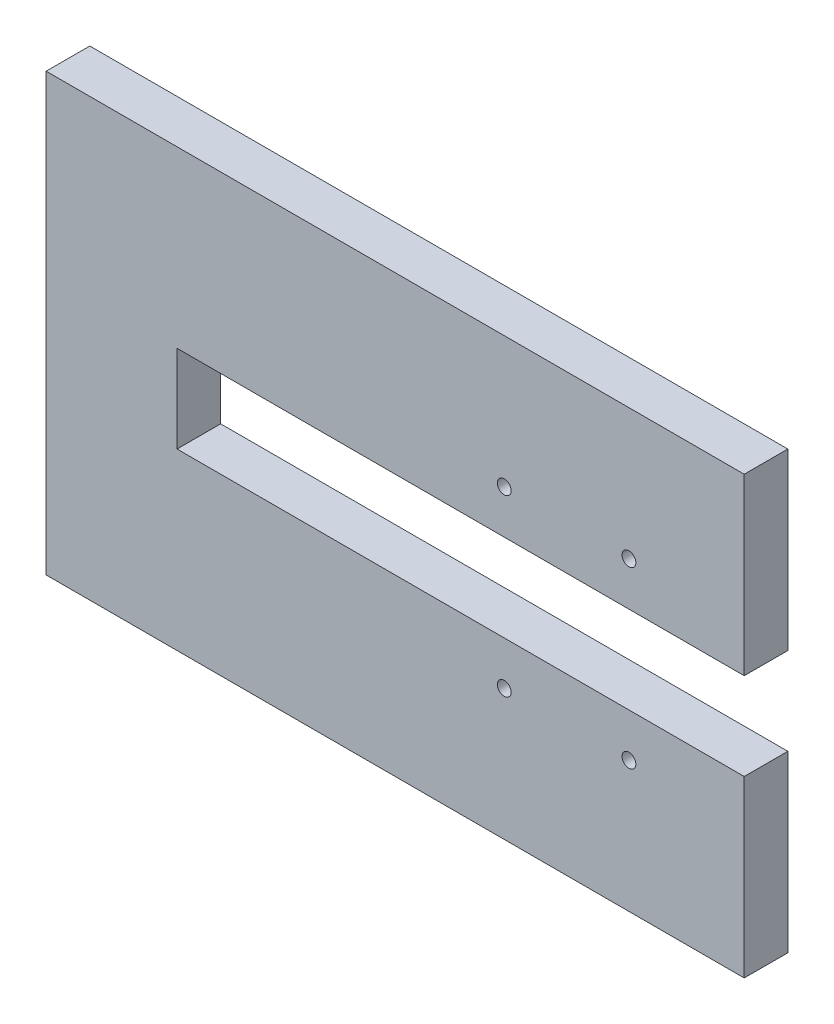
ISO-10303-21;
HEADER;
FILE_DESCRIPTION(('STEP AP214'),'2;1');
FILE_NAME('part.step','',(''),(''),'','','');
FILE_SCHEMA(('AUTOMOTIVE_DESIGN { 1 0 10303 214 1 1 1 1 }'));
ENDSEC;
DATA;
#1=APPLICATION_CONTEXT('core data for automotive mechanical design processes');
#2=APPLICATION_PROTOCOL_DEFINITION('international standard','automotive_design',2000,#1);
#3=PRODUCT_CONTEXT('',#1,'mechanical');
#4=PRODUCT('Part','Part','',(#3));
#5=PRODUCT_RELATED_PRODUCT_CATEGORY('part','',(#4));
#6=PRODUCT_DEFINITION_FORMATION('','',#4);
#7=PRODUCT_DEFINITION_CONTEXT('part definition',#1,'design');
#8=PRODUCT_DEFINITION('design','',#6,#7);
#9=PRODUCT_DEFINITION_SHAPE('','',#8);
#10=(LENGTH_UNIT() NAMED_UNIT(*) SI_UNIT(.MILLI.,.METRE.));
#11=(NAMED_UNIT(*) PLANE_ANGLE_UNIT() SI_UNIT($,.RADIAN.));
#12=(NAMED_UNIT(*) SI_UNIT($,.STERADIAN.) SOLID_ANGLE_UNIT());
#13=UNCERTAINTY_MEASURE_WITH_UNIT(LENGTH_MEASURE(1.E-05),#10,'distance_accuracy_value','');
#14=(GEOMETRIC_REPRESENTATION_CONTEXT(3) GLOBAL_UNCERTAINTY_ASSIGNED_CONTEXT((#13)) GLOBAL_UNIT_ASSIGNED_CONTEXT((#10,
#11,#12)) REPRESENTATION_CONTEXT('',''));
#15=CARTESIAN_POINT('',(0.,0.,0.));
#16=DIRECTION('',(0.,0.,1.));
#17=DIRECTION('',(1.,0.,0.));
#18=AXIS2_PLACEMENT_3D('',#15,#16,#17);
#19=CARTESIAN_POINT('',(0.,0.,10.));
#20=DIRECTION('',(0.,0.,1.));
#21=DIRECTION('',(1.,0.,0.));
#22=AXIS2_PLACEMENT_3D('',#19,#20,#21);
#23=PLANE('',#22);
#24=CARTESIAN_POINT('',(51.4623762836953,-5.11498133483865,10.));
#25=DIRECTION('',(0.,0.,1.));
#26=DIRECTION('',(1.,0.,0.));
#27=AXIS2_PLACEMENT_3D('',#24,#25,#26);
#28=CIRCLE('',#27,1.5875);
#29=CARTESIAN_POINT('',(53.0498762836953,-5.11498133483865,10.));
#30=VERTEX_POINT('',#29);
#31=EDGE_CURVE('E187',#30,#30,#28,.T.);
#32=ORIENTED_EDGE('',*,*,#31,.F.);
#33=EDGE_LOOP('',(#32));
#34=FACE_BOUND('',#33,.T.);
#35=CARTESIAN_POINT('',(51.4623762836953,34.8850186651615,10.));
#36=DIRECTION('',(0.,0.,1.));
#37=DIRECTION('',(1.,0.,0.));
#38=AXIS2_PLACEMENT_3D('',#35,#36,#37);
#39=CIRCLE('',#38,1.5875);
#40=CARTESIAN_POINT('',(53.0498762836953,34.8850186651615,10.));
#41=VERTEX_POINT('',#40);
#42=EDGE_CURVE('E133',#41,#41,#39,.T.);
#43=ORIENTED_EDGE('',*,*,#42,.F.);
#44=EDGE_LOOP('',(#43));
#45=FACE_BOUND('',#44,.T.);
#46=DIRECTION('',(0.,-1.,0.));
#47=VECTOR('',#46,1.);
#48=CARTESIAN_POINT('',(-53.5376237163047,64.8850186651614,10.));
#49=LINE('',#48,#47);
#50=CARTESIAN_POINT('',(-53.5376237163047,64.8850186651614,10.));
#51=VERTEX_POINT('',#50);
#52=CARTESIAN_POINT('',(-53.5376237163047,-35.1149813348386,10.));
#53=VERTEX_POINT('',#52);
#54=EDGE_CURVE('E144',#51,#53,#49,.T.);
#55=ORIENTED_EDGE('',*,*,#54,.T.);
#56=DIRECTION('',(1.,0.,0.));
#57=VECTOR('',#56,1.);
#58=CARTESIAN_POINT('',(-53.5376237163047,-35.1149813348386,10.));
#59=LINE('',#58,#57);
#60=CARTESIAN_POINT('',(106.462376283695,-35.1149813348386,10.));
#61=VERTEX_POINT('',#60);
#62=EDGE_CURVE('E92',#53,#61,#59,.T.);
#63=ORIENTED_EDGE('',*,*,#62,.T.);
#64=DIRECTION('',(0.,1.,0.));
#65=VECTOR('',#64,1.);
#66=CARTESIAN_POINT('',(106.462376283695,-35.1149813348386,10.));
#67=LINE('',#66,#65);
#68=CARTESIAN_POINT('',(106.462376283695,4.88501866516136,10.));
#69=VERTEX_POINT('',#68);
#70=EDGE_CURVE('E159',#61,#69,#67,.T.);
#71=ORIENTED_EDGE('',*,*,#70,.T.);
#72=DIRECTION('',(-1.,0.,0.));
#73=VECTOR('',#72,1.);
#74=CARTESIAN_POINT('',(106.462376283695,4.88501866516136,10.));
#75=LINE('',#74,#73);
#76=CARTESIAN_POINT('',(-23.5376237163047,4.88501866516135,10.));
#77=VERTEX_POINT('',#76);
#78=EDGE_CURVE('E172',#69,#77,#75,.T.);
#79=ORIENTED_EDGE('',*,*,#78,.T.);
#80=DIRECTION('',(0.,1.,0.));
#81=VECTOR('',#80,1.);
#82=CARTESIAN_POINT('',(-23.5376237163047,24.8850186651614,10.));
#83=LINE('',#82,#81);
#84=CARTESIAN_POINT('',(-23.5376237163047,24.8850186651614,10.));
#85=VERTEX_POINT('',#84);
#86=EDGE_CURVE('E111',#77,#85,#83,.T.);
#87=ORIENTED_EDGE('',*,*,#86,.T.);
#88=DIRECTION('',(1.,0.,0.));
#89=VECTOR('',#88,1.);
#90=CARTESIAN_POINT('',(106.462376283695,24.8850186651614,10.));
#91=LINE('',#90,#89);
#92=CARTESIAN_POINT('',(106.462376283695,24.8850186651614,10.));
#93=VERTEX_POINT('',#92);
#94=EDGE_CURVE('E105',#85,#93,#91,.T.);
#95=ORIENTED_EDGE('',*,*,#94,.T.);
#96=DIRECTION('',(0.,1.,0.));
#97=VECTOR('',#96,1.);
#98=CARTESIAN_POINT('',(106.462376283695,64.8850186651614,10.));
#99=LINE('',#98,#97);
#100=CARTESIAN_POINT('',(106.462376283695,64.8850186651614,10.));
#101=VERTEX_POINT('',#100);
#102=EDGE_CURVE('E109',#93,#101,#99,.T.);
#103=ORIENTED_EDGE('',*,*,#102,.T.);
#104=DIRECTION('',(-1.,0.,0.));
#105=VECTOR('',#104,1.);
#106=CARTESIAN_POINT('',(-53.5376237163047,64.8850186651614,10.));
#107=LINE('',#106,#105);
#108=EDGE_CURVE('E49',#101,#51,#107,.T.);
#109=ORIENTED_EDGE('',*,*,#108,.T.);
#110=EDGE_LOOP('',(#55,#63,#71,#79,#87,#95,#103,#109));
#111=FACE_BOUND('',#110,.T.);
#112=CARTESIAN_POINT('',(80.0373762836953,34.8850186651615,10.));
#113=DIRECTION('',(0.,0.,1.));
#114=DIRECTION('',(1.,0.,0.));
#115=AXIS2_PLACEMENT_3D('',#112,#113,#114);
#116=CIRCLE('',#115,1.58749999999999);
#117=CARTESIAN_POINT('',(81.6248762836952,34.8850186651615,10.));
#118=VERTEX_POINT('',#117);
#119=EDGE_CURVE('E181',#118,#118,#116,.T.);
#120=ORIENTED_EDGE('',*,*,#119,.F.);
#121=EDGE_LOOP('',(#120));
#122=FACE_BOUND('',#121,.T.);
#123=CARTESIAN_POINT('',(80.0373762836952,-5.11498133483865,10.));
#124=DIRECTION('',(0.,0.,1.));
#125=DIRECTION('',(1.,0.,0.));
#126=AXIS2_PLACEMENT_3D('',#123,#124,#125);
#127=CIRCLE('',#126,1.5875);
#128=CARTESIAN_POINT('',(81.6248762836952,-5.11498133483865,10.));
#129=VERTEX_POINT('',#128);
#130=EDGE_CURVE('E193',#129,#129,#127,.T.);
#131=ORIENTED_EDGE('',*,*,#130,.F.);
#132=EDGE_LOOP('',(#131));
#133=FACE_BOUND('',#132,.T.);
#134=ADVANCED_FACE('F32',(#34,#45,#111,#122,#133),#23,.T.);
#135=CARTESIAN_POINT('',(0.,0.,0.));
#136=DIRECTION('',(0.,0.,1.));
#137=DIRECTION('',(1.,0.,0.));
#138=AXIS2_PLACEMENT_3D('',#135,#136,#137);
#139=PLANE('',#138);
#140=CARTESIAN_POINT('',(51.4623762836953,-5.11498133483865,0.));
#141=DIRECTION('',(0.,0.,1.));
#142=DIRECTION('',(1.,0.,0.));
#143=AXIS2_PLACEMENT_3D('',#140,#141,#142);
#144=CIRCLE('',#143,1.5875);
#145=CARTESIAN_POINT('',(53.0498762836953,-5.11498133483865,0.));
#146=VERTEX_POINT('',#145);
#147=EDGE_CURVE('E190',#146,#146,#144,.T.);
#148=ORIENTED_EDGE('',*,*,#147,.T.);
#149=EDGE_LOOP('',(#148));
#150=FACE_BOUND('',#149,.T.);
#151=CARTESIAN_POINT('',(51.4623762836953,34.8850186651615,0.));
#152=DIRECTION('',(0.,0.,1.));
#153=DIRECTION('',(1.,0.,0.));
#154=AXIS2_PLACEMENT_3D('',#151,#152,#153);
#155=CIRCLE('',#154,1.5875);
#156=CARTESIAN_POINT('',(53.0498762836953,34.8850186651615,0.));
#157=VERTEX_POINT('',#156);
#158=EDGE_CURVE('E178',#157,#157,#155,.T.);
#159=ORIENTED_EDGE('',*,*,#158,.T.);
#160=EDGE_LOOP('',(#159));
#161=FACE_BOUND('',#160,.T.);
#162=DIRECTION('',(0.,-1.,0.));
#163=VECTOR('',#162,1.);
#164=CARTESIAN_POINT('',(-53.5376237163047,64.8850186651614,0.));
#165=LINE('',#164,#163);
#166=CARTESIAN_POINT('',(-53.5376237163047,64.8850186651614,0.));
#167=VERTEX_POINT('',#166);
#168=CARTESIAN_POINT('',(-53.5376237163047,-35.1149813348386,0.));
#169=VERTEX_POINT('',#168);
#170=EDGE_CURVE('E129',#167,#169,#165,.T.);
#171=ORIENTED_EDGE('',*,*,#170,.F.);
#172=DIRECTION('',(-1.,0.,0.));
#173=VECTOR('',#172,1.);
#174=CARTESIAN_POINT('',(-53.5376237163047,64.8850186651614,0.));
#175=LINE('',#174,#173);
#176=CARTESIAN_POINT('',(106.462376283695,64.8850186651614,0.));
#177=VERTEX_POINT('',#176);
#178=EDGE_CURVE('E84',#177,#167,#175,.T.);
#179=ORIENTED_EDGE('',*,*,#178,.F.);
#180=DIRECTION('',(0.,1.,0.));
#181=VECTOR('',#180,1.);
#182=CARTESIAN_POINT('',(106.462376283695,64.8850186651614,0.));
#183=LINE('',#182,#181);
#184=CARTESIAN_POINT('',(106.462376283695,24.8850186651614,0.));
#185=VERTEX_POINT('',#184);
#186=EDGE_CURVE('E78',#185,#177,#183,.T.);
#187=ORIENTED_EDGE('',*,*,#186,.F.);
#188=DIRECTION('',(1.,0.,0.));
#189=VECTOR('',#188,1.);
#190=CARTESIAN_POINT('',(106.462376283695,24.8850186651614,0.));
#191=LINE('',#190,#189);
#192=CARTESIAN_POINT('',(-23.5376237163047,24.8850186651614,0.));
#193=VERTEX_POINT('',#192);
#194=EDGE_CURVE('E119',#193,#185,#191,.T.);
#195=ORIENTED_EDGE('',*,*,#194,.F.);
#196=DIRECTION('',(0.,1.,0.));
#197=VECTOR('',#196,1.);
#198=CARTESIAN_POINT('',(-23.5376237163047,24.8850186651614,0.));
#199=LINE('',#198,#197);
#200=CARTESIAN_POINT('',(-23.5376237163047,4.88501866516135,0.));
#201=VERTEX_POINT('',#200);
#202=EDGE_CURVE('E139',#201,#193,#199,.T.);
#203=ORIENTED_EDGE('',*,*,#202,.F.);
#204=DIRECTION('',(-1.,0.,0.));
#205=VECTOR('',#204,1.);
#206=CARTESIAN_POINT('',(106.462376283695,4.88501866516136,0.));
#207=LINE('',#206,#205);
#208=CARTESIAN_POINT('',(106.462376283695,4.88501866516136,0.));
#209=VERTEX_POINT('',#208);
#210=EDGE_CURVE('E137',#209,#201,#207,.T.);
#211=ORIENTED_EDGE('',*,*,#210,.F.);
#212=DIRECTION('',(0.,1.,0.));
#213=VECTOR('',#212,1.);
#214=CARTESIAN_POINT('',(106.462376283695,-35.1149813348386,0.));
#215=LINE('',#214,#213);
#216=CARTESIAN_POINT('',(106.462376283695,-35.1149813348386,0.));
#217=VERTEX_POINT('',#216);
#218=EDGE_CURVE('E135',#217,#209,#215,.T.);
#219=ORIENTED_EDGE('',*,*,#218,.F.);
#220=DIRECTION('',(1.,0.,0.));
#221=VECTOR('',#220,1.);
#222=CARTESIAN_POINT('',(-53.5376237163047,-35.1149813348386,0.));
#223=LINE('',#222,#221);
#224=EDGE_CURVE('E132',#169,#217,#223,.T.);
#225=ORIENTED_EDGE('',*,*,#224,.F.);
#226=EDGE_LOOP('',(#171,#179,#187,#195,#203,#211,#219,#225));
#227=FACE_BOUND('',#226,.T.);
#228=CARTESIAN_POINT('',(80.0373762836953,34.8850186651615,0.));
#229=DIRECTION('',(0.,0.,1.));
#230=DIRECTION('',(1.,0.,0.));
#231=AXIS2_PLACEMENT_3D('',#228,#229,#230);
#232=CIRCLE('',#231,1.58749999999999);
#233=CARTESIAN_POINT('',(81.6248762836952,34.8850186651615,0.));
#234=VERTEX_POINT('',#233);
#235=EDGE_CURVE('E184',#234,#234,#232,.T.);
#236=ORIENTED_EDGE('',*,*,#235,.T.);
#237=EDGE_LOOP('',(#236));
#238=FACE_BOUND('',#237,.T.);
#239=CARTESIAN_POINT('',(80.0373762836952,-5.11498133483865,0.));
#240=DIRECTION('',(0.,0.,1.));
#241=DIRECTION('',(1.,0.,0.));
#242=AXIS2_PLACEMENT_3D('',#239,#240,#241);
#243=CIRCLE('',#242,1.5875);
#244=CARTESIAN_POINT('',(81.6248762836952,-5.11498133483865,0.));
#245=VERTEX_POINT('',#244);
#246=EDGE_CURVE('E196',#245,#245,#243,.T.);
#247=ORIENTED_EDGE('',*,*,#246,.T.);
#248=EDGE_LOOP('',(#247));
#249=FACE_BOUND('',#248,.T.);
#250=ADVANCED_FACE('F163',(#150,#161,#227,#238,#249),#139,.F.);
#251=CARTESIAN_POINT('',(-53.5376237163047,64.8850186651614,10.));
#252=DIRECTION('',(1.,0.,0.));
#253=DIRECTION('',(0.,1.,0.));
#254=AXIS2_PLACEMENT_3D('',#251,#252,#253);
#255=PLANE('',#254);
#256=ORIENTED_EDGE('',*,*,#170,.T.);
#257=DIRECTION('',(0.,0.,-1.));
#258=VECTOR('',#257,1.);
#259=CARTESIAN_POINT('',(-53.5376237163047,-35.1149813348386,10.));
#260=LINE('',#259,#258);
#261=EDGE_CURVE('E11',#53,#169,#260,.T.);
#262=ORIENTED_EDGE('',*,*,#261,.F.);
#263=ORIENTED_EDGE('',*,*,#54,.F.);
#264=DIRECTION('',(0.,0.,-1.));
#265=VECTOR('',#264,1.);
#266=CARTESIAN_POINT('',(-53.5376237163047,64.8850186651614,10.));
#267=LINE('',#266,#265);
#268=EDGE_CURVE('E125',#51,#167,#267,.T.);
#269=ORIENTED_EDGE('',*,*,#268,.T.);
#270=EDGE_LOOP('',(#256,#262,#263,#269));
#271=FACE_BOUND('',#270,.T.);
#272=ADVANCED_FACE('F34',(#271),#255,.F.);
#273=CARTESIAN_POINT('',(-53.5376237163047,-35.1149813348386,10.));
#274=DIRECTION('',(0.,1.,0.));
#275=DIRECTION('',(-1.,0.,0.));
#276=AXIS2_PLACEMENT_3D('',#273,#274,#275);
#277=PLANE('',#276);
#278=ORIENTED_EDGE('',*,*,#224,.T.);
#279=DIRECTION('',(0.,0.,-1.));
#280=VECTOR('',#279,1.);
#281=CARTESIAN_POINT('',(106.462376283695,-35.1149813348386,10.));
#282=LINE('',#281,#280);
#283=EDGE_CURVE('E41',#61,#217,#282,.T.);
#284=ORIENTED_EDGE('',*,*,#283,.F.);
#285=ORIENTED_EDGE('',*,*,#62,.F.);
#286=ORIENTED_EDGE('',*,*,#261,.T.);
#287=EDGE_LOOP('',(#278,#284,#285,#286));
#288=FACE_BOUND('',#287,.T.);
#289=ADVANCED_FACE('F231',(#288),#277,.F.);
#290=CARTESIAN_POINT('',(106.462376283695,-35.1149813348386,10.));
#291=DIRECTION('',(-1.,0.,0.));
#292=DIRECTION('',(0.,-1.,0.));
#293=AXIS2_PLACEMENT_3D('',#290,#291,#292);
#294=PLANE('',#293);
#295=ORIENTED_EDGE('',*,*,#218,.T.);
#296=DIRECTION('',(0.,0.,-1.));
#297=VECTOR('',#296,1.);
#298=CARTESIAN_POINT('',(106.462376283695,4.88501866516136,10.));
#299=LINE('',#298,#297);
#300=EDGE_CURVE('E151',#69,#209,#299,.T.);
#301=ORIENTED_EDGE('',*,*,#300,.F.);
#302=ORIENTED_EDGE('',*,*,#70,.F.);
#303=ORIENTED_EDGE('',*,*,#283,.T.);
#304=EDGE_LOOP('',(#295,#301,#302,#303));
#305=FACE_BOUND('',#304,.T.);
#306=ADVANCED_FACE('F157',(#305),#294,.F.);
#307=CARTESIAN_POINT('',(106.462376283695,4.88501866516136,10.));
#308=DIRECTION('',(0.,-1.,0.));
#309=DIRECTION('',(1.,0.,0.));
#310=AXIS2_PLACEMENT_3D('',#307,#308,#309);
#311=PLANE('',#310);
#312=ORIENTED_EDGE('',*,*,#210,.T.);
#313=DIRECTION('',(0.,0.,-1.));
#314=VECTOR('',#313,1.);
#315=CARTESIAN_POINT('',(-23.5376237163047,4.88501866516135,10.));
#316=LINE('',#315,#314);
#317=EDGE_CURVE('E148',#77,#201,#316,.T.);
#318=ORIENTED_EDGE('',*,*,#317,.F.);
#319=ORIENTED_EDGE('',*,*,#78,.F.);
#320=ORIENTED_EDGE('',*,*,#300,.T.);
#321=EDGE_LOOP('',(#312,#318,#319,#320));
#322=FACE_BOUND('',#321,.T.);
#323=ADVANCED_FACE('F168',(#322),#311,.F.);
#324=CARTESIAN_POINT('',(-23.5376237163047,24.8850186651614,10.));
#325=DIRECTION('',(-1.,0.,0.));
#326=DIRECTION('',(0.,0.,1.));
#327=AXIS2_PLACEMENT_3D('',#324,#325,#326);
#328=PLANE('',#327);
#329=ORIENTED_EDGE('',*,*,#202,.T.);
#330=DIRECTION('',(0.,0.,-1.));
#331=VECTOR('',#330,1.);
#332=CARTESIAN_POINT('',(-23.5376237163047,24.8850186651614,10.));
#333=LINE('',#332,#331);
#334=EDGE_CURVE('E120',#85,#193,#333,.T.);
#335=ORIENTED_EDGE('',*,*,#334,.F.);
#336=ORIENTED_EDGE('',*,*,#86,.F.);
#337=ORIENTED_EDGE('',*,*,#317,.T.);
#338=EDGE_LOOP('',(#329,#335,#336,#337));
#339=FACE_BOUND('',#338,.T.);
#340=ADVANCED_FACE('F171',(#339),#328,.F.);
#341=CARTESIAN_POINT('',(106.462376283695,24.8850186651614,10.));
#342=DIRECTION('',(0.,1.,0.));
#343=DIRECTION('',(0.,0.,1.));
#344=AXIS2_PLACEMENT_3D('',#341,#342,#343);
#345=PLANE('',#344);
#346=ORIENTED_EDGE('',*,*,#194,.T.);
#347=DIRECTION('',(0.,0.,-1.));
#348=VECTOR('',#347,1.);
#349=CARTESIAN_POINT('',(106.462376283695,24.8850186651614,10.));
#350=LINE('',#349,#348);
#351=EDGE_CURVE('E116',#93,#185,#350,.T.);
#352=ORIENTED_EDGE('',*,*,#351,.F.);
#353=ORIENTED_EDGE('',*,*,#94,.F.);
#354=ORIENTED_EDGE('',*,*,#334,.T.);
#355=EDGE_LOOP('',(#346,#352,#353,#354));
#356=FACE_BOUND('',#355,.T.);
#357=ADVANCED_FACE('F117',(#356),#345,.F.);
#358=CARTESIAN_POINT('',(106.462376283695,64.8850186651614,10.));
#359=DIRECTION('',(-1.,0.,0.));
#360=DIRECTION('',(0.,0.,1.));
#361=AXIS2_PLACEMENT_3D('',#358,#359,#360);
#362=PLANE('',#361);
#363=ORIENTED_EDGE('',*,*,#186,.T.);
#364=DIRECTION('',(0.,0.,-1.));
#365=VECTOR('',#364,1.);
#366=CARTESIAN_POINT('',(106.462376283695,64.8850186651614,10.));
#367=LINE('',#366,#365);
#368=EDGE_CURVE('E121',#101,#177,#367,.T.);
#369=ORIENTED_EDGE('',*,*,#368,.F.);
#370=ORIENTED_EDGE('',*,*,#102,.F.);
#371=ORIENTED_EDGE('',*,*,#351,.T.);
#372=EDGE_LOOP('',(#363,#369,#370,#371));
#373=FACE_BOUND('',#372,.T.);
#374=ADVANCED_FACE('F123',(#373),#362,.F.);
#375=CARTESIAN_POINT('',(-53.5376237163047,64.8850186651614,10.));
#376=DIRECTION('',(0.,-1.,0.));
#377=DIRECTION('',(1.,0.,0.));
#378=AXIS2_PLACEMENT_3D('',#375,#376,#377);
#379=PLANE('',#378);
#380=ORIENTED_EDGE('',*,*,#178,.T.);
#381=ORIENTED_EDGE('',*,*,#268,.F.);
#382=ORIENTED_EDGE('',*,*,#108,.F.);
#383=ORIENTED_EDGE('',*,*,#368,.T.);
#384=EDGE_LOOP('',(#380,#381,#382,#383));
#385=FACE_BOUND('',#384,.T.);
#386=ADVANCED_FACE('F219',(#385),#379,.F.);
#387=CARTESIAN_POINT('',(51.4623762836953,34.8850186651615,10.));
#388=DIRECTION('',(0.,0.,-1.));
#389=DIRECTION('',(-1.,0.,0.));
#390=AXIS2_PLACEMENT_3D('',#387,#388,#389);
#391=CYLINDRICAL_SURFACE('',#390,1.5875);
#392=ORIENTED_EDGE('',*,*,#42,.T.);
#393=EDGE_LOOP('',(#392));
#394=FACE_BOUND('',#393,.T.);
#395=ORIENTED_EDGE('',*,*,#158,.F.);
#396=EDGE_LOOP('',(#395));
#397=FACE_BOUND('',#396,.T.);
#398=ADVANCED_FACE('F216',(#394,#397),#391,.F.);
#399=CARTESIAN_POINT('',(80.0373762836953,34.8850186651615,10.));
#400=DIRECTION('',(0.,0.,-1.));
#401=DIRECTION('',(-1.,0.,0.));
#402=AXIS2_PLACEMENT_3D('',#399,#400,#401);
#403=CYLINDRICAL_SURFACE('',#402,1.58749999999999);
#404=ORIENTED_EDGE('',*,*,#119,.T.);
#405=EDGE_LOOP('',(#404));
#406=FACE_BOUND('',#405,.T.);
#407=ORIENTED_EDGE('',*,*,#235,.F.);
#408=EDGE_LOOP('',(#407));
#409=FACE_BOUND('',#408,.T.);
#410=ADVANCED_FACE('F295',(#406,#409),#403,.F.);
#411=CARTESIAN_POINT('',(51.4623762836953,-5.11498133483865,10.));
#412=DIRECTION('',(0.,0.,-1.));
#413=DIRECTION('',(-1.,0.,0.));
#414=AXIS2_PLACEMENT_3D('',#411,#412,#413);
#415=CYLINDRICAL_SURFACE('',#414,1.5875);
#416=ORIENTED_EDGE('',*,*,#31,.T.);
#417=EDGE_LOOP('',(#416));
#418=FACE_BOUND('',#417,.T.);
#419=ORIENTED_EDGE('',*,*,#147,.F.);
#420=EDGE_LOOP('',(#419));
#421=FACE_BOUND('',#420,.T.);
#422=ADVANCED_FACE('F303',(#418,#421),#415,.F.);
#423=CARTESIAN_POINT('',(80.0373762836952,-5.11498133483865,10.));
#424=DIRECTION('',(0.,0.,-1.));
#425=DIRECTION('',(-1.,0.,0.));
#426=AXIS2_PLACEMENT_3D('',#423,#424,#425);
#427=CYLINDRICAL_SURFACE('',#426,1.5875);
#428=ORIENTED_EDGE('',*,*,#130,.T.);
#429=EDGE_LOOP('',(#428));
#430=FACE_BOUND('',#429,.T.);
#431=ORIENTED_EDGE('',*,*,#246,.F.);
#432=EDGE_LOOP('',(#431));
#433=FACE_BOUND('',#432,.T.);
#434=ADVANCED_FACE('F202',(#430,#433),#427,.F.);
#435=CLOSED_SHELL('',(#134,#250,#272,#289,#306,#323,#340,#357,#374,#386,#398,#410,#422,#434));
#436=MANIFOLD_SOLID_BREP('B2',#435);
#437=ADVANCED_BREP_SHAPE_REPRESENTATION('',(#18,#436),#14);
#438=SHAPE_DEFINITION_REPRESENTATION(#9,#437);
ENDSEC;
END-ISO-10303-21;
